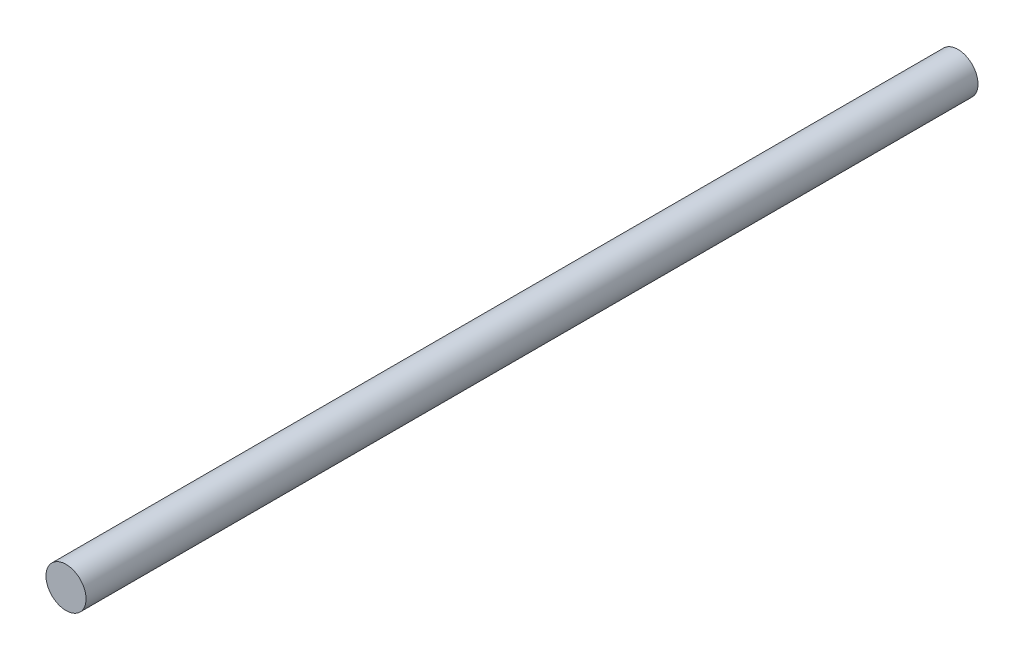
ISO-10303-21;
HEADER;
FILE_DESCRIPTION(('STEP AP214'),'2;1');
FILE_NAME('part.step','',(''),(''),'','','');
FILE_SCHEMA(('AUTOMOTIVE_DESIGN { 1 0 10303 214 1 1 1 1 }'));
ENDSEC;
DATA;
#1=APPLICATION_CONTEXT('core data for automotive mechanical design processes');
#2=APPLICATION_PROTOCOL_DEFINITION('international standard','automotive_design',2000,#1);
#3=PRODUCT_CONTEXT('',#1,'mechanical');
#4=PRODUCT('Part','Part','',(#3));
#5=PRODUCT_RELATED_PRODUCT_CATEGORY('part','',(#4));
#6=PRODUCT_DEFINITION_FORMATION('','',#4);
#7=PRODUCT_DEFINITION_CONTEXT('part definition',#1,'design');
#8=PRODUCT_DEFINITION('design','',#6,#7);
#9=PRODUCT_DEFINITION_SHAPE('','',#8);
#10=(LENGTH_UNIT() NAMED_UNIT(*) SI_UNIT(.MILLI.,.METRE.));
#11=(NAMED_UNIT(*) PLANE_ANGLE_UNIT() SI_UNIT($,.RADIAN.));
#12=(NAMED_UNIT(*) SI_UNIT($,.STERADIAN.) SOLID_ANGLE_UNIT());
#13=UNCERTAINTY_MEASURE_WITH_UNIT(LENGTH_MEASURE(1.E-05),#10,'distance_accuracy_value','');
#14=(GEOMETRIC_REPRESENTATION_CONTEXT(3) GLOBAL_UNCERTAINTY_ASSIGNED_CONTEXT((#13)) GLOBAL_UNIT_ASSIGNED_CONTEXT((#10,
#11,#12)) REPRESENTATION_CONTEXT('',''));
#15=CARTESIAN_POINT('',(0.,0.,0.));
#16=DIRECTION('',(0.,0.,1.));
#17=DIRECTION('',(1.,0.,0.));
#18=AXIS2_PLACEMENT_3D('',#15,#16,#17);
#19=CARTESIAN_POINT('',(0.,0.,222.4));
#20=DIRECTION('',(0.,0.,-1.));
#21=DIRECTION('',(-1.,0.,0.));
#22=AXIS2_PLACEMENT_3D('',#19,#20,#21);
#23=CYLINDRICAL_SURFACE('',#22,5.);
#24=CARTESIAN_POINT('',(0.,0.,222.4));
#25=DIRECTION('',(0.,0.,1.));
#26=DIRECTION('',(1.,0.,0.));
#27=AXIS2_PLACEMENT_3D('',#24,#25,#26);
#28=CIRCLE('',#27,5.);
#29=CARTESIAN_POINT('',(5.,0.,222.4));
#30=VERTEX_POINT('',#29);
#31=EDGE_CURVE('E10',#30,#30,#28,.T.);
#32=ORIENTED_EDGE('',*,*,#31,.F.);
#33=EDGE_LOOP('',(#32));
#34=FACE_BOUND('',#33,.T.);
#35=CARTESIAN_POINT('',(0.,0.,0.));
#36=DIRECTION('',(0.,0.,1.));
#37=DIRECTION('',(1.,0.,0.));
#38=AXIS2_PLACEMENT_3D('',#35,#36,#37);
#39=CIRCLE('',#38,5.);
#40=CARTESIAN_POINT('',(5.,0.,0.));
#41=VERTEX_POINT('',#40);
#42=EDGE_CURVE('E38',#41,#41,#39,.T.);
#43=ORIENTED_EDGE('',*,*,#42,.T.);
#44=EDGE_LOOP('',(#43));
#45=FACE_BOUND('',#44,.T.);
#46=ADVANCED_FACE('F35',(#34,#45),#23,.T.);
#47=CARTESIAN_POINT('',(0.,0.,222.4));
#48=DIRECTION('',(0.,0.,1.));
#49=DIRECTION('',(1.,0.,0.));
#50=AXIS2_PLACEMENT_3D('',#47,#48,#49);
#51=PLANE('',#50);
#52=ORIENTED_EDGE('',*,*,#31,.T.);
#53=EDGE_LOOP('',(#52));
#54=FACE_BOUND('',#53,.T.);
#55=ADVANCED_FACE('F50',(#54),#51,.T.);
#56=CARTESIAN_POINT('',(0.,0.,0.));
#57=DIRECTION('',(0.,0.,1.));
#58=DIRECTION('',(1.,0.,0.));
#59=AXIS2_PLACEMENT_3D('',#56,#57,#58);
#60=PLANE('',#59);
#61=ORIENTED_EDGE('',*,*,#42,.F.);
#62=EDGE_LOOP('',(#61));
#63=FACE_BOUND('',#62,.T.);
#64=ADVANCED_FACE('F48',(#63),#60,.F.);
#65=CLOSED_SHELL('',(#46,#55,#64));
#66=MANIFOLD_SOLID_BREP('B2',#65);
#67=ADVANCED_BREP_SHAPE_REPRESENTATION('',(#18,#66),#14);
#68=SHAPE_DEFINITION_REPRESENTATION(#9,#67);
ENDSEC;
END-ISO-10303-21;
